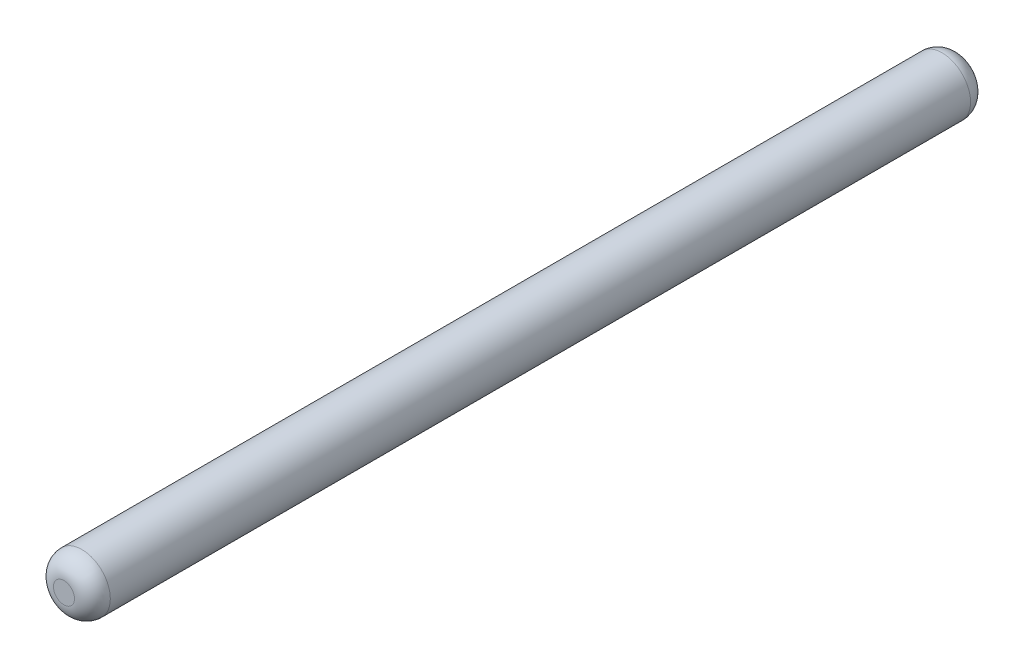
ISO-10303-21;
HEADER;
FILE_DESCRIPTION(('STEP AP214'),'2;1');
FILE_NAME('part.step','',(''),(''),'','','');
FILE_SCHEMA(('AUTOMOTIVE_DESIGN { 1 0 10303 214 1 1 1 1 }'));
ENDSEC;
DATA;
#1=APPLICATION_CONTEXT('core data for automotive mechanical design processes');
#2=APPLICATION_PROTOCOL_DEFINITION('international standard','automotive_design',2000,#1);
#3=PRODUCT_CONTEXT('',#1,'mechanical');
#4=PRODUCT('Part','Part','',(#3));
#5=PRODUCT_RELATED_PRODUCT_CATEGORY('part','',(#4));
#6=PRODUCT_DEFINITION_FORMATION('','',#4);
#7=PRODUCT_DEFINITION_CONTEXT('part definition',#1,'design');
#8=PRODUCT_DEFINITION('design','',#6,#7);
#9=PRODUCT_DEFINITION_SHAPE('','',#8);
#10=(LENGTH_UNIT() NAMED_UNIT(*) SI_UNIT(.MILLI.,.METRE.));
#11=(NAMED_UNIT(*) PLANE_ANGLE_UNIT() SI_UNIT($,.RADIAN.));
#12=(NAMED_UNIT(*) SI_UNIT($,.STERADIAN.) SOLID_ANGLE_UNIT());
#13=UNCERTAINTY_MEASURE_WITH_UNIT(LENGTH_MEASURE(1.E-05),#10,'distance_accuracy_value','');
#14=(GEOMETRIC_REPRESENTATION_CONTEXT(3) GLOBAL_UNCERTAINTY_ASSIGNED_CONTEXT((#13)) GLOBAL_UNIT_ASSIGNED_CONTEXT((#10,
#11,#12)) REPRESENTATION_CONTEXT('',''));
#15=CARTESIAN_POINT('',(0.,0.,0.));
#16=DIRECTION('',(0.,0.,1.));
#17=DIRECTION('',(1.,0.,0.));
#18=AXIS2_PLACEMENT_3D('',#15,#16,#17);
#19=CARTESIAN_POINT('',(0.,0.,100.));
#20=DIRECTION('',(0.,0.,-1.));
#21=DIRECTION('',(-1.,0.,0.));
#22=AXIS2_PLACEMENT_3D('',#19,#20,#21);
#23=CYLINDRICAL_SURFACE('',#22,3.175);
#24=CARTESIAN_POINT('',(0.,0.,98.));
#25=DIRECTION('',(0.,0.,1.));
#26=DIRECTION('',(1.,0.,0.));
#27=AXIS2_PLACEMENT_3D('',#24,#25,#26);
#28=CIRCLE('',#27,3.175);
#29=CARTESIAN_POINT('',(3.175,0.,98.));
#30=VERTEX_POINT('',#29);
#31=EDGE_CURVE('E37',#30,#30,#28,.F.);
#32=ORIENTED_EDGE('',*,*,#31,.T.);
#33=EDGE_LOOP('',(#32));
#34=FACE_BOUND('',#33,.T.);
#35=CARTESIAN_POINT('',(0.,0.,2.));
#36=DIRECTION('',(0.,0.,1.));
#37=DIRECTION('',(1.,0.,0.));
#38=AXIS2_PLACEMENT_3D('',#35,#36,#37);
#39=CIRCLE('',#38,3.175);
#40=CARTESIAN_POINT('',(3.175,0.,2.));
#41=VERTEX_POINT('',#40);
#42=EDGE_CURVE('E41',#41,#41,#39,.T.);
#43=ORIENTED_EDGE('',*,*,#42,.T.);
#44=EDGE_LOOP('',(#43));
#45=FACE_BOUND('',#44,.T.);
#46=ADVANCED_FACE('F30',(#34,#45),#23,.T.);
#47=CARTESIAN_POINT('',(0.,0.,100.));
#48=DIRECTION('',(0.,0.,1.));
#49=DIRECTION('',(1.,0.,0.));
#50=AXIS2_PLACEMENT_3D('',#47,#48,#49);
#51=PLANE('',#50);
#52=CARTESIAN_POINT('',(0.,0.,100.));
#53=DIRECTION('',(0.,0.,1.));
#54=DIRECTION('',(1.,0.,0.));
#55=AXIS2_PLACEMENT_3D('',#52,#53,#54);
#56=CIRCLE('',#55,1.175);
#57=CARTESIAN_POINT('',(1.175,0.,100.));
#58=VERTEX_POINT('',#57);
#59=EDGE_CURVE('E45',#58,#58,#56,.T.);
#60=ORIENTED_EDGE('',*,*,#59,.T.);
#61=EDGE_LOOP('',(#60));
#62=FACE_BOUND('',#61,.T.);
#63=ADVANCED_FACE('F51',(#62),#51,.T.);
#64=CARTESIAN_POINT('',(0.,0.,0.));
#65=DIRECTION('',(0.,0.,1.));
#66=DIRECTION('',(1.,0.,0.));
#67=AXIS2_PLACEMENT_3D('',#64,#65,#66);
#68=PLANE('',#67);
#69=CARTESIAN_POINT('',(0.,0.,0.));
#70=DIRECTION('',(0.,0.,1.));
#71=DIRECTION('',(1.,0.,0.));
#72=AXIS2_PLACEMENT_3D('',#69,#70,#71);
#73=CIRCLE('',#72,1.175);
#74=CARTESIAN_POINT('',(1.175,0.,0.));
#75=VERTEX_POINT('',#74);
#76=EDGE_CURVE('E10',#75,#75,#73,.F.);
#77=ORIENTED_EDGE('',*,*,#76,.T.);
#78=EDGE_LOOP('',(#77));
#79=FACE_BOUND('',#78,.T.);
#80=ADVANCED_FACE('F55',(#79),#68,.F.);
#81=CARTESIAN_POINT('',(0.,0.,98.));
#82=DIRECTION('',(0.,0.,1.));
#83=DIRECTION('',(1.,0.,0.));
#84=AXIS2_PLACEMENT_3D('',#81,#82,#83);
#85=DEGENERATE_TOROIDAL_SURFACE('',#84,1.175,2.,.T.);
#86=ORIENTED_EDGE('',*,*,#31,.F.);
#87=EDGE_LOOP('',(#86));
#88=FACE_BOUND('',#87,.T.);
#89=ORIENTED_EDGE('',*,*,#59,.F.);
#90=EDGE_LOOP('',(#89));
#91=FACE_BOUND('',#90,.T.);
#92=ADVANCED_FACE('F53',(#88,#91),#85,.T.);
#93=CARTESIAN_POINT('',(0.,0.,2.));
#94=DIRECTION('',(0.,0.,1.));
#95=DIRECTION('',(1.,0.,0.));
#96=AXIS2_PLACEMENT_3D('',#93,#94,#95);
#97=DEGENERATE_TOROIDAL_SURFACE('',#96,1.175,2.,.T.);
#98=ORIENTED_EDGE('',*,*,#76,.F.);
#99=EDGE_LOOP('',(#98));
#100=FACE_BOUND('',#99,.T.);
#101=ORIENTED_EDGE('',*,*,#42,.F.);
#102=EDGE_LOOP('',(#101));
#103=FACE_BOUND('',#102,.T.);
#104=ADVANCED_FACE('F32',(#100,#103),#97,.T.);
#105=CLOSED_SHELL('',(#46,#63,#80,#92,#104));
#106=MANIFOLD_SOLID_BREP('B2',#105);
#107=ADVANCED_BREP_SHAPE_REPRESENTATION('',(#18,#106),#14);
#108=SHAPE_DEFINITION_REPRESENTATION(#9,#107);
ENDSEC;
END-ISO-10303-21;
